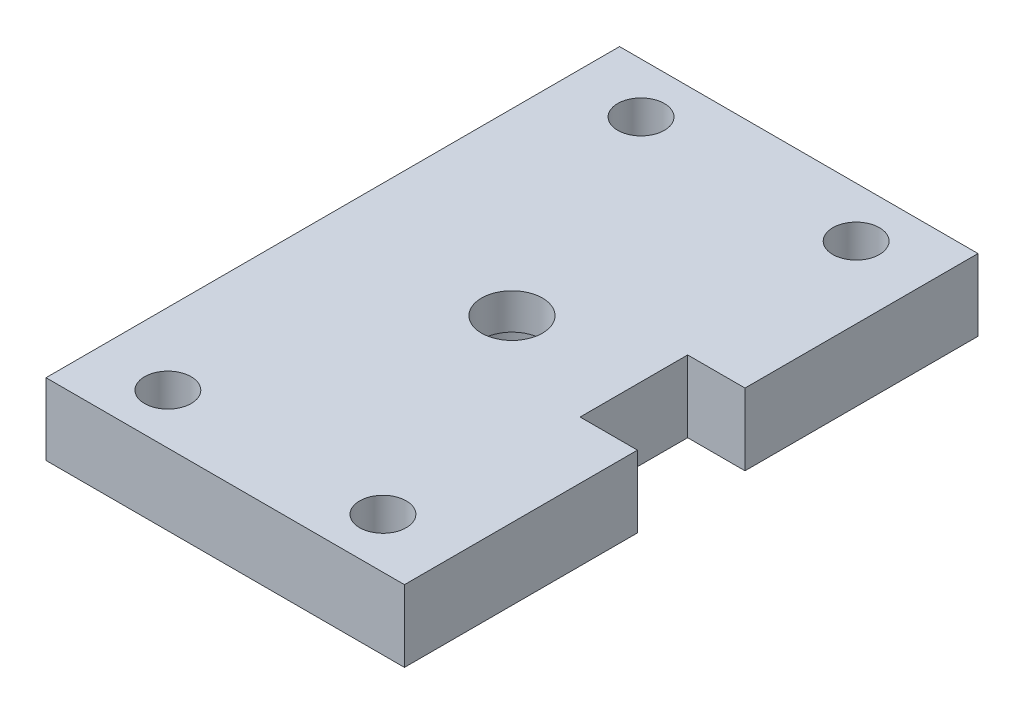
ISO-10303-21;
HEADER;
FILE_DESCRIPTION(('STEP AP214'),'2;1');
FILE_NAME('part.step','',(''),(''),'','','');
FILE_SCHEMA(('AUTOMOTIVE_DESIGN { 1 0 10303 214 1 1 1 1 }'));
ENDSEC;
DATA;
#1=APPLICATION_CONTEXT('core data for automotive mechanical design processes');
#2=APPLICATION_PROTOCOL_DEFINITION('international standard','automotive_design',2000,#1);
#3=PRODUCT_CONTEXT('',#1,'mechanical');
#4=PRODUCT('Part','Part','',(#3));
#5=PRODUCT_RELATED_PRODUCT_CATEGORY('part','',(#4));
#6=PRODUCT_DEFINITION_FORMATION('','',#4);
#7=PRODUCT_DEFINITION_CONTEXT('part definition',#1,'design');
#8=PRODUCT_DEFINITION('design','',#6,#7);
#9=PRODUCT_DEFINITION_SHAPE('','',#8);
#10=(LENGTH_UNIT() NAMED_UNIT(*) SI_UNIT(.MILLI.,.METRE.));
#11=(NAMED_UNIT(*) PLANE_ANGLE_UNIT() SI_UNIT($,.RADIAN.));
#12=(NAMED_UNIT(*) SI_UNIT($,.STERADIAN.) SOLID_ANGLE_UNIT());
#13=UNCERTAINTY_MEASURE_WITH_UNIT(LENGTH_MEASURE(1.E-05),#10,'distance_accuracy_value','');
#14=(GEOMETRIC_REPRESENTATION_CONTEXT(3) GLOBAL_UNCERTAINTY_ASSIGNED_CONTEXT((#13)) GLOBAL_UNIT_ASSIGNED_CONTEXT((#10,
#11,#12)) REPRESENTATION_CONTEXT('',''));
#15=CARTESIAN_POINT('',(0.,0.,0.));
#16=DIRECTION('',(0.,0.,1.));
#17=DIRECTION('',(1.,0.,0.));
#18=AXIS2_PLACEMENT_3D('',#15,#16,#17);
#19=CARTESIAN_POINT('',(30.890258641776,10.,46.7413790928147));
#20=DIRECTION('',(-1.,0.,0.));
#21=DIRECTION('',(0.,0.,1.));
#22=AXIS2_PLACEMENT_3D('',#19,#20,#21);
#23=PLANE('',#22);
#24=DIRECTION('',(0.,0.,-1.));
#25=VECTOR('',#24,1.);
#26=CARTESIAN_POINT('',(30.890258641776,10.,46.7413790928147));
#27=LINE('',#26,#25);
#28=CARTESIAN_POINT('',(30.890258641776,10.,-0.758620907185252));
#29=VERTEX_POINT('',#28);
#30=CARTESIAN_POINT('',(30.890258641776,10.,-33.2586209071853));
#31=VERTEX_POINT('',#30);
#32=EDGE_CURVE('E90',#29,#31,#27,.T.);
#33=ORIENTED_EDGE('',*,*,#32,.F.);
#34=DIRECTION('',(0.,1.,0.));
#35=VECTOR('',#34,1.);
#36=CARTESIAN_POINT('',(30.890258641776,0.,-0.758620907185252));
#37=LINE('',#36,#35);
#38=CARTESIAN_POINT('',(30.890258641776,0.,-0.758620907185252));
#39=VERTEX_POINT('',#38);
#40=EDGE_CURVE('E145',#39,#29,#37,.T.);
#41=ORIENTED_EDGE('',*,*,#40,.F.);
#42=DIRECTION('',(0.,0.,-1.));
#43=VECTOR('',#42,1.);
#44=CARTESIAN_POINT('',(30.890258641776,0.,46.7413790928147));
#45=LINE('',#44,#43);
#46=CARTESIAN_POINT('',(30.890258641776,0.,-33.2586209071853));
#47=VERTEX_POINT('',#46);
#48=EDGE_CURVE('E180',#39,#47,#45,.T.);
#49=ORIENTED_EDGE('',*,*,#48,.T.);
#50=DIRECTION('',(0.,-1.,0.));
#51=VECTOR('',#50,1.);
#52=CARTESIAN_POINT('',(30.890258641776,10.,-33.2586209071853));
#53=LINE('',#52,#51);
#54=EDGE_CURVE('E11',#31,#47,#53,.T.);
#55=ORIENTED_EDGE('',*,*,#54,.F.);
#56=EDGE_LOOP('',(#33,#41,#49,#55));
#57=FACE_BOUND('',#56,.T.);
#58=ADVANCED_FACE('F37',(#57),#23,.F.);
#59=CARTESIAN_POINT('',(5.89025864177597,10.001,6.74137909281474));
#60=DIRECTION('',(0.,-1.,0.));
#61=DIRECTION('',(0.,0.,-1.));
#62=AXIS2_PLACEMENT_3D('',#59,#60,#61);
#63=CYLINDRICAL_SURFACE('',#62,4.25);
#64=CARTESIAN_POINT('',(5.89025864177597,10.,6.74137909281474));
#65=DIRECTION('',(0.,-1.,0.));
#66=DIRECTION('',(0.,0.,-1.));
#67=AXIS2_PLACEMENT_3D('',#64,#65,#66);
#68=CIRCLE('',#67,4.25);
#69=CARTESIAN_POINT('',(5.89025864177597,10.,2.49137909281474));
#70=VERTEX_POINT('',#69);
#71=EDGE_CURVE('E175',#70,#70,#68,.F.);
#72=ORIENTED_EDGE('',*,*,#71,.T.);
#73=EDGE_LOOP('',(#72));
#74=FACE_BOUND('',#73,.T.);
#75=CARTESIAN_POINT('',(5.89025864177597,5.,6.74137909281474));
#76=DIRECTION('',(0.,-1.,0.));
#77=DIRECTION('',(0.,0.,-1.));
#78=AXIS2_PLACEMENT_3D('',#75,#76,#77);
#79=CIRCLE('',#78,4.25);
#80=CARTESIAN_POINT('',(5.89025864177597,5.,2.49137909281474));
#81=VERTEX_POINT('',#80);
#82=EDGE_CURVE('E41',#81,#81,#79,.F.);
#83=ORIENTED_EDGE('',*,*,#82,.F.);
#84=EDGE_LOOP('',(#83));
#85=FACE_BOUND('',#84,.T.);
#86=ADVANCED_FACE('F225',(#74,#85),#63,.F.);
#87=CARTESIAN_POINT('',(30.890258641776,0.,46.7413790928147));
#88=VERTEX_POINT('',#87);
#89=CARTESIAN_POINT('',(30.890258641776,0.,14.2413790928147));
#90=VERTEX_POINT('',#89);
#91=EDGE_CURVE('E189',#88,#90,#45,.T.);
#92=ORIENTED_EDGE('',*,*,#91,.T.);
#93=DIRECTION('',(0.,1.,0.));
#94=VECTOR('',#93,1.);
#95=CARTESIAN_POINT('',(30.890258641776,0.,14.2413790928147));
#96=LINE('',#95,#94);
#97=CARTESIAN_POINT('',(30.890258641776,10.,14.2413790928147));
#98=VERTEX_POINT('',#97);
#99=EDGE_CURVE('E53',#90,#98,#96,.T.);
#100=ORIENTED_EDGE('',*,*,#99,.T.);
#101=CARTESIAN_POINT('',(30.890258641776,10.,46.7413790928147));
#102=VERTEX_POINT('',#101);
#103=EDGE_CURVE('E181',#102,#98,#27,.T.);
#104=ORIENTED_EDGE('',*,*,#103,.F.);
#105=DIRECTION('',(0.,-1.,0.));
#106=VECTOR('',#105,1.);
#107=CARTESIAN_POINT('',(30.890258641776,10.,46.7413790928147));
#108=LINE('',#107,#106);
#109=EDGE_CURVE('E188',#102,#88,#108,.T.);
#110=ORIENTED_EDGE('',*,*,#109,.T.);
#111=EDGE_LOOP('',(#92,#100,#104,#110));
#112=FACE_BOUND('',#111,.T.);
#113=ADVANCED_FACE('F39',(#112),#23,.F.);
#114=CARTESIAN_POINT('',(-19.109741358224,10.,-33.2586209071853));
#115=DIRECTION('',(0.,0.,1.));
#116=DIRECTION('',(1.,0.,0.));
#117=AXIS2_PLACEMENT_3D('',#114,#115,#116);
#118=PLANE('',#117);
#119=DIRECTION('',(-1.,0.,0.));
#120=VECTOR('',#119,1.);
#121=CARTESIAN_POINT('',(-19.109741358224,0.,-33.2586209071853));
#122=LINE('',#121,#120);
#123=CARTESIAN_POINT('',(-19.109741358224,0.,-33.2586209071853));
#124=VERTEX_POINT('',#123);
#125=EDGE_CURVE('E191',#47,#124,#122,.T.);
#126=ORIENTED_EDGE('',*,*,#125,.T.);
#127=DIRECTION('',(0.,-1.,0.));
#128=VECTOR('',#127,1.);
#129=CARTESIAN_POINT('',(-19.109741358224,10.,-33.2586209071853));
#130=LINE('',#129,#128);
#131=CARTESIAN_POINT('',(-19.109741358224,10.,-33.2586209071853));
#132=VERTEX_POINT('',#131);
#133=EDGE_CURVE('E46',#132,#124,#130,.T.);
#134=ORIENTED_EDGE('',*,*,#133,.F.);
#135=DIRECTION('',(-1.,0.,0.));
#136=VECTOR('',#135,1.);
#137=CARTESIAN_POINT('',(-19.109741358224,10.,-33.2586209071853));
#138=LINE('',#137,#136);
#139=EDGE_CURVE('E183',#31,#132,#138,.T.);
#140=ORIENTED_EDGE('',*,*,#139,.F.);
#141=ORIENTED_EDGE('',*,*,#54,.T.);
#142=EDGE_LOOP('',(#126,#134,#140,#141));
#143=FACE_BOUND('',#142,.T.);
#144=ADVANCED_FACE('F221',(#143),#118,.F.);
#145=CARTESIAN_POINT('',(-19.109741358224,10.,46.7413790928147));
#146=DIRECTION('',(1.,0.,0.));
#147=DIRECTION('',(0.,0.,-1.));
#148=AXIS2_PLACEMENT_3D('',#145,#146,#147);
#149=PLANE('',#148);
#150=DIRECTION('',(0.,0.,1.));
#151=VECTOR('',#150,1.);
#152=CARTESIAN_POINT('',(-19.109741358224,0.,46.7413790928147));
#153=LINE('',#152,#151);
#154=CARTESIAN_POINT('',(-19.109741358224,0.,46.7413790928147));
#155=VERTEX_POINT('',#154);
#156=EDGE_CURVE('E193',#124,#155,#153,.T.);
#157=ORIENTED_EDGE('',*,*,#156,.T.);
#158=DIRECTION('',(0.,-1.,0.));
#159=VECTOR('',#158,1.);
#160=CARTESIAN_POINT('',(-19.109741358224,10.,46.7413790928147));
#161=LINE('',#160,#159);
#162=CARTESIAN_POINT('',(-19.109741358224,10.,46.7413790928147));
#163=VERTEX_POINT('',#162);
#164=EDGE_CURVE('E197',#163,#155,#161,.T.);
#165=ORIENTED_EDGE('',*,*,#164,.F.);
#166=DIRECTION('',(0.,0.,1.));
#167=VECTOR('',#166,1.);
#168=CARTESIAN_POINT('',(-19.109741358224,10.,46.7413790928147));
#169=LINE('',#168,#167);
#170=EDGE_CURVE('E185',#132,#163,#169,.T.);
#171=ORIENTED_EDGE('',*,*,#170,.F.);
#172=ORIENTED_EDGE('',*,*,#133,.T.);
#173=EDGE_LOOP('',(#157,#165,#171,#172));
#174=FACE_BOUND('',#173,.T.);
#175=ADVANCED_FACE('F204',(#174),#149,.F.);
#176=CARTESIAN_POINT('',(-19.109741358224,10.,46.7413790928147));
#177=DIRECTION('',(0.,0.,-1.));
#178=DIRECTION('',(-1.,0.,0.));
#179=AXIS2_PLACEMENT_3D('',#176,#177,#178);
#180=PLANE('',#179);
#181=DIRECTION('',(1.,0.,0.));
#182=VECTOR('',#181,1.);
#183=CARTESIAN_POINT('',(-19.109741358224,0.,46.7413790928147));
#184=LINE('',#183,#182);
#185=EDGE_CURVE('E83',#155,#88,#184,.T.);
#186=ORIENTED_EDGE('',*,*,#185,.T.);
#187=ORIENTED_EDGE('',*,*,#109,.F.);
#188=DIRECTION('',(1.,0.,0.));
#189=VECTOR('',#188,1.);
#190=CARTESIAN_POINT('',(-19.109741358224,10.,46.7413790928147));
#191=LINE('',#190,#189);
#192=EDGE_CURVE('E62',#163,#102,#191,.T.);
#193=ORIENTED_EDGE('',*,*,#192,.F.);
#194=ORIENTED_EDGE('',*,*,#164,.T.);
#195=EDGE_LOOP('',(#186,#187,#193,#194));
#196=FACE_BOUND('',#195,.T.);
#197=ADVANCED_FACE('F210',(#196),#180,.F.);
#198=CARTESIAN_POINT('',(0.,10.,0.));
#199=DIRECTION('',(0.,-1.,0.));
#200=DIRECTION('',(0.,0.,-1.));
#201=AXIS2_PLACEMENT_3D('',#198,#199,#200);
#202=PLANE('',#201);
#203=CARTESIAN_POINT('',(20.890258641776,10.,39.7413790928147));
#204=DIRECTION('',(0.,1.,0.));
#205=DIRECTION('',(0.,0.,1.));
#206=AXIS2_PLACEMENT_3D('',#203,#204,#205);
#207=CIRCLE('',#206,3.25);
#208=CARTESIAN_POINT('',(20.890258641776,10.,42.9913790928148));
#209=VERTEX_POINT('',#208);
#210=EDGE_CURVE('E160',#209,#209,#207,.T.);
#211=ORIENTED_EDGE('',*,*,#210,.F.);
#212=EDGE_LOOP('',(#211));
#213=FACE_BOUND('',#212,.T.);
#214=CARTESIAN_POINT('',(-9.10974135822403,10.,-26.2586209071853));
#215=DIRECTION('',(0.,1.,0.));
#216=DIRECTION('',(0.,0.,1.));
#217=AXIS2_PLACEMENT_3D('',#214,#215,#216);
#218=CIRCLE('',#217,3.25);
#219=CARTESIAN_POINT('',(-9.10974135822403,10.,-23.0086209071853));
#220=VERTEX_POINT('',#219);
#221=EDGE_CURVE('E167',#220,#220,#218,.T.);
#222=ORIENTED_EDGE('',*,*,#221,.F.);
#223=EDGE_LOOP('',(#222));
#224=FACE_BOUND('',#223,.T.);
#225=CARTESIAN_POINT('',(20.890258641776,10.,-26.2586209071853));
#226=DIRECTION('',(0.,1.,0.));
#227=DIRECTION('',(0.,0.,1.));
#228=AXIS2_PLACEMENT_3D('',#225,#226,#227);
#229=CIRCLE('',#228,3.25);
#230=CARTESIAN_POINT('',(20.890258641776,10.,-23.0086209071853));
#231=VERTEX_POINT('',#230);
#232=EDGE_CURVE('E153',#231,#231,#229,.T.);
#233=ORIENTED_EDGE('',*,*,#232,.F.);
#234=EDGE_LOOP('',(#233));
#235=FACE_BOUND('',#234,.T.);
#236=CARTESIAN_POINT('',(-9.10974135822403,10.,39.7413790928148));
#237=DIRECTION('',(0.,1.,0.));
#238=DIRECTION('',(0.,0.,1.));
#239=AXIS2_PLACEMENT_3D('',#236,#237,#238);
#240=CIRCLE('',#239,3.25);
#241=CARTESIAN_POINT('',(-9.10974135822403,10.,42.9913790928148));
#242=VERTEX_POINT('',#241);
#243=EDGE_CURVE('E172',#242,#242,#240,.T.);
#244=ORIENTED_EDGE('',*,*,#243,.F.);
#245=EDGE_LOOP('',(#244));
#246=FACE_BOUND('',#245,.T.);
#247=ORIENTED_EDGE('',*,*,#71,.F.);
#248=EDGE_LOOP('',(#247));
#249=FACE_BOUND('',#248,.T.);
#250=DIRECTION('',(0.,0.,1.));
#251=VECTOR('',#250,1.);
#252=CARTESIAN_POINT('',(22.890258641776,10.,14.2413790928147));
#253=LINE('',#252,#251);
#254=CARTESIAN_POINT('',(22.890258641776,10.,-0.758620907185252));
#255=VERTEX_POINT('',#254);
#256=CARTESIAN_POINT('',(22.890258641776,10.,14.2413790928147));
#257=VERTEX_POINT('',#256);
#258=EDGE_CURVE('E120',#255,#257,#253,.T.);
#259=ORIENTED_EDGE('',*,*,#258,.F.);
#260=DIRECTION('',(-1.,0.,0.));
#261=VECTOR('',#260,1.);
#262=CARTESIAN_POINT('',(22.890258641776,10.,-0.758620907185252));
#263=LINE('',#262,#261);
#264=EDGE_CURVE('E133',#29,#255,#263,.T.);
#265=ORIENTED_EDGE('',*,*,#264,.F.);
#266=ORIENTED_EDGE('',*,*,#32,.T.);
#267=ORIENTED_EDGE('',*,*,#139,.T.);
#268=ORIENTED_EDGE('',*,*,#170,.T.);
#269=ORIENTED_EDGE('',*,*,#192,.T.);
#270=ORIENTED_EDGE('',*,*,#103,.T.);
#271=DIRECTION('',(1.,0.,0.));
#272=VECTOR('',#271,1.);
#273=CARTESIAN_POINT('',(22.890258641776,10.,14.2413790928147));
#274=LINE('',#273,#272);
#275=EDGE_CURVE('E136',#257,#98,#274,.T.);
#276=ORIENTED_EDGE('',*,*,#275,.F.);
#277=EDGE_LOOP('',(#259,#265,#266,#267,#268,#269,#270,#276));
#278=FACE_BOUND('',#277,.T.);
#279=ADVANCED_FACE('F212',(#213,#224,#235,#246,#249,#278),#202,.F.);
#280=CARTESIAN_POINT('',(0.,0.,0.));
#281=DIRECTION('',(0.,-1.,0.));
#282=DIRECTION('',(0.,0.,-1.));
#283=AXIS2_PLACEMENT_3D('',#280,#281,#282);
#284=PLANE('',#283);
#285=DIRECTION('',(-1.,0.,0.));
#286=VECTOR('',#285,1.);
#287=CARTESIAN_POINT('',(22.890258641776,0.,-0.758620907185252));
#288=LINE('',#287,#286);
#289=CARTESIAN_POINT('',(22.890258641776,0.,-0.758620907185252));
#290=VERTEX_POINT('',#289);
#291=EDGE_CURVE('E122',#39,#290,#288,.T.);
#292=ORIENTED_EDGE('',*,*,#291,.T.);
#293=DIRECTION('',(0.,0.,1.));
#294=VECTOR('',#293,1.);
#295=CARTESIAN_POINT('',(22.890258641776,0.,14.2413790928147));
#296=LINE('',#295,#294);
#297=CARTESIAN_POINT('',(22.890258641776,0.,14.2413790928147));
#298=VERTEX_POINT('',#297);
#299=EDGE_CURVE('E117',#290,#298,#296,.T.);
#300=ORIENTED_EDGE('',*,*,#299,.T.);
#301=DIRECTION('',(1.,0.,0.));
#302=VECTOR('',#301,1.);
#303=CARTESIAN_POINT('',(22.890258641776,0.,14.2413790928147));
#304=LINE('',#303,#302);
#305=EDGE_CURVE('E124',#298,#90,#304,.T.);
#306=ORIENTED_EDGE('',*,*,#305,.T.);
#307=ORIENTED_EDGE('',*,*,#91,.F.);
#308=ORIENTED_EDGE('',*,*,#185,.F.);
#309=ORIENTED_EDGE('',*,*,#156,.F.);
#310=ORIENTED_EDGE('',*,*,#125,.F.);
#311=ORIENTED_EDGE('',*,*,#48,.F.);
#312=EDGE_LOOP('',(#292,#300,#306,#307,#308,#309,#310,#311));
#313=FACE_BOUND('',#312,.T.);
#314=CARTESIAN_POINT('',(5.89025864177589,0.,6.74137909281491));
#315=DIRECTION('',(0.,-1.,0.));
#316=DIRECTION('',(0.,0.,-1.));
#317=AXIS2_PLACEMENT_3D('',#314,#315,#316);
#318=CIRCLE('',#317,7.5);
#319=CARTESIAN_POINT('',(5.89025864177589,0.,-0.758620907185085));
#320=VERTEX_POINT('',#319);
#321=EDGE_CURVE('E144',#320,#320,#318,.T.);
#322=ORIENTED_EDGE('',*,*,#321,.F.);
#323=EDGE_LOOP('',(#322));
#324=FACE_BOUND('',#323,.T.);
#325=CARTESIAN_POINT('',(20.890258641776,0.,39.7413790928147));
#326=DIRECTION('',(0.,-1.,0.));
#327=DIRECTION('',(0.,0.,-1.));
#328=AXIS2_PLACEMENT_3D('',#325,#326,#327);
#329=CIRCLE('',#328,3.25);
#330=CARTESIAN_POINT('',(20.890258641776,0.,36.4913790928147));
#331=VERTEX_POINT('',#330);
#332=EDGE_CURVE('E164',#331,#331,#329,.F.);
#333=ORIENTED_EDGE('',*,*,#332,.T.);
#334=EDGE_LOOP('',(#333));
#335=FACE_BOUND('',#334,.T.);
#336=CARTESIAN_POINT('',(-9.10974135822403,0.,-26.2586209071853));
#337=DIRECTION('',(0.,-1.,0.));
#338=DIRECTION('',(0.,0.,-1.));
#339=AXIS2_PLACEMENT_3D('',#336,#337,#338);
#340=CIRCLE('',#339,3.25);
#341=CARTESIAN_POINT('',(-9.10974135822403,0.,-29.5086209071853));
#342=VERTEX_POINT('',#341);
#343=EDGE_CURVE('E156',#342,#342,#340,.F.);
#344=ORIENTED_EDGE('',*,*,#343,.T.);
#345=EDGE_LOOP('',(#344));
#346=FACE_BOUND('',#345,.T.);
#347=CARTESIAN_POINT('',(20.890258641776,0.,-26.2586209071853));
#348=DIRECTION('',(0.,-1.,0.));
#349=DIRECTION('',(0.,0.,-1.));
#350=AXIS2_PLACEMENT_3D('',#347,#348,#349);
#351=CIRCLE('',#350,3.25);
#352=CARTESIAN_POINT('',(20.890258641776,0.,-29.5086209071853));
#353=VERTEX_POINT('',#352);
#354=EDGE_CURVE('E157',#353,#353,#351,.F.);
#355=ORIENTED_EDGE('',*,*,#354,.T.);
#356=EDGE_LOOP('',(#355));
#357=FACE_BOUND('',#356,.T.);
#358=CARTESIAN_POINT('',(-9.10974135822403,0.,39.7413790928148));
#359=DIRECTION('',(0.,-1.,0.));
#360=DIRECTION('',(0.,0.,-1.));
#361=AXIS2_PLACEMENT_3D('',#358,#359,#360);
#362=CIRCLE('',#361,3.25);
#363=CARTESIAN_POINT('',(-9.10974135822403,0.,36.4913790928148));
#364=VERTEX_POINT('',#363);
#365=EDGE_CURVE('E163',#364,#364,#362,.F.);
#366=ORIENTED_EDGE('',*,*,#365,.T.);
#367=EDGE_LOOP('',(#366));
#368=FACE_BOUND('',#367,.T.);
#369=ADVANCED_FACE('F130',(#313,#324,#335,#346,#357,#368),#284,.T.);
#370=CARTESIAN_POINT('',(-9.10974135822403,-0.000999999999999265,39.7413790928148));
#371=DIRECTION('',(0.,1.,0.));
#372=DIRECTION('',(0.,0.,1.));
#373=AXIS2_PLACEMENT_3D('',#370,#371,#372);
#374=CYLINDRICAL_SURFACE('',#373,3.25);
#375=ORIENTED_EDGE('',*,*,#365,.F.);
#376=EDGE_LOOP('',(#375));
#377=FACE_BOUND('',#376,.T.);
#378=ORIENTED_EDGE('',*,*,#243,.T.);
#379=EDGE_LOOP('',(#378));
#380=FACE_BOUND('',#379,.T.);
#381=ADVANCED_FACE('F265',(#377,#380),#374,.F.);
#382=CARTESIAN_POINT('',(20.890258641776,-0.000999999999999265,-26.2586209071853));
#383=DIRECTION('',(0.,1.,0.));
#384=DIRECTION('',(0.,0.,1.));
#385=AXIS2_PLACEMENT_3D('',#382,#383,#384);
#386=CYLINDRICAL_SURFACE('',#385,3.25);
#387=ORIENTED_EDGE('',*,*,#354,.F.);
#388=EDGE_LOOP('',(#387));
#389=FACE_BOUND('',#388,.T.);
#390=ORIENTED_EDGE('',*,*,#232,.T.);
#391=EDGE_LOOP('',(#390));
#392=FACE_BOUND('',#391,.T.);
#393=ADVANCED_FACE('F261',(#389,#392),#386,.F.);
#394=CARTESIAN_POINT('',(-9.10974135822403,-0.000999999999999265,-26.2586209071853));
#395=DIRECTION('',(0.,1.,0.));
#396=DIRECTION('',(0.,0.,1.));
#397=AXIS2_PLACEMENT_3D('',#394,#395,#396);
#398=CYLINDRICAL_SURFACE('',#397,3.25);
#399=ORIENTED_EDGE('',*,*,#343,.F.);
#400=EDGE_LOOP('',(#399));
#401=FACE_BOUND('',#400,.T.);
#402=ORIENTED_EDGE('',*,*,#221,.T.);
#403=EDGE_LOOP('',(#402));
#404=FACE_BOUND('',#403,.T.);
#405=ADVANCED_FACE('F264',(#401,#404),#398,.F.);
#406=CARTESIAN_POINT('',(20.890258641776,-0.000999999999999265,39.7413790928147));
#407=DIRECTION('',(0.,1.,0.));
#408=DIRECTION('',(0.,0.,1.));
#409=AXIS2_PLACEMENT_3D('',#406,#407,#408);
#410=CYLINDRICAL_SURFACE('',#409,3.25);
#411=ORIENTED_EDGE('',*,*,#332,.F.);
#412=EDGE_LOOP('',(#411));
#413=FACE_BOUND('',#412,.T.);
#414=ORIENTED_EDGE('',*,*,#210,.T.);
#415=EDGE_LOOP('',(#414));
#416=FACE_BOUND('',#415,.T.);
#417=ADVANCED_FACE('F256',(#413,#416),#410,.F.);
#418=CARTESIAN_POINT('',(5.89025864177589,5.,6.74137909281491));
#419=DIRECTION('',(0.,-1.,0.));
#420=DIRECTION('',(0.,0.,-1.));
#421=AXIS2_PLACEMENT_3D('',#418,#419,#420);
#422=PLANE('',#421);
#423=CARTESIAN_POINT('',(5.89025864177589,5.,6.74137909281491));
#424=DIRECTION('',(0.,-1.,0.));
#425=DIRECTION('',(0.,0.,-1.));
#426=AXIS2_PLACEMENT_3D('',#423,#424,#425);
#427=CIRCLE('',#426,7.5);
#428=CARTESIAN_POINT('',(5.89025864177589,5.,-0.758620907185085));
#429=VERTEX_POINT('',#428);
#430=EDGE_CURVE('E148',#429,#429,#427,.T.);
#431=ORIENTED_EDGE('',*,*,#430,.T.);
#432=EDGE_LOOP('',(#431));
#433=FACE_BOUND('',#432,.T.);
#434=ORIENTED_EDGE('',*,*,#82,.T.);
#435=EDGE_LOOP('',(#434));
#436=FACE_BOUND('',#435,.T.);
#437=ADVANCED_FACE('F253',(#433,#436),#422,.T.);
#438=CARTESIAN_POINT('',(5.89025864177589,5.,6.74137909281491));
#439=DIRECTION('',(0.,-1.,0.));
#440=DIRECTION('',(0.,0.,-1.));
#441=AXIS2_PLACEMENT_3D('',#438,#439,#440);
#442=CYLINDRICAL_SURFACE('',#441,7.5);
#443=ORIENTED_EDGE('',*,*,#430,.F.);
#444=EDGE_LOOP('',(#443));
#445=FACE_BOUND('',#444,.T.);
#446=ORIENTED_EDGE('',*,*,#321,.T.);
#447=EDGE_LOOP('',(#446));
#448=FACE_BOUND('',#447,.T.);
#449=ADVANCED_FACE('F250',(#445,#448),#442,.F.);
#450=CARTESIAN_POINT('',(22.890258641776,0.,14.2413790928147));
#451=DIRECTION('',(-1.,0.,0.));
#452=DIRECTION('',(0.,0.,1.));
#453=AXIS2_PLACEMENT_3D('',#450,#451,#452);
#454=PLANE('',#453);
#455=ORIENTED_EDGE('',*,*,#258,.T.);
#456=DIRECTION('',(0.,1.,0.));
#457=VECTOR('',#456,1.);
#458=CARTESIAN_POINT('',(22.890258641776,0.,14.2413790928147));
#459=LINE('',#458,#457);
#460=EDGE_CURVE('E114',#298,#257,#459,.T.);
#461=ORIENTED_EDGE('',*,*,#460,.F.);
#462=ORIENTED_EDGE('',*,*,#299,.F.);
#463=DIRECTION('',(0.,1.,0.));
#464=VECTOR('',#463,1.);
#465=CARTESIAN_POINT('',(22.890258641776,0.,-0.758620907185252));
#466=LINE('',#465,#464);
#467=EDGE_CURVE('E142',#290,#255,#466,.T.);
#468=ORIENTED_EDGE('',*,*,#467,.T.);
#469=EDGE_LOOP('',(#455,#461,#462,#468));
#470=FACE_BOUND('',#469,.T.);
#471=ADVANCED_FACE('F115',(#470),#454,.F.);
#472=CARTESIAN_POINT('',(22.890258641776,0.,-0.758620907185252));
#473=DIRECTION('',(0.,0.,-1.));
#474=DIRECTION('',(-1.,0.,0.));
#475=AXIS2_PLACEMENT_3D('',#472,#473,#474);
#476=PLANE('',#475);
#477=ORIENTED_EDGE('',*,*,#264,.T.);
#478=ORIENTED_EDGE('',*,*,#467,.F.);
#479=ORIENTED_EDGE('',*,*,#291,.F.);
#480=ORIENTED_EDGE('',*,*,#40,.T.);
#481=EDGE_LOOP('',(#477,#478,#479,#480));
#482=FACE_BOUND('',#481,.T.);
#483=ADVANCED_FACE('F242',(#482),#476,.F.);
#484=CARTESIAN_POINT('',(22.890258641776,0.,14.2413790928147));
#485=DIRECTION('',(0.,0.,1.));
#486=DIRECTION('',(1.,0.,0.));
#487=AXIS2_PLACEMENT_3D('',#484,#485,#486);
#488=PLANE('',#487);
#489=ORIENTED_EDGE('',*,*,#275,.T.);
#490=ORIENTED_EDGE('',*,*,#99,.F.);
#491=ORIENTED_EDGE('',*,*,#305,.F.);
#492=ORIENTED_EDGE('',*,*,#460,.T.);
#493=EDGE_LOOP('',(#489,#490,#491,#492));
#494=FACE_BOUND('',#493,.T.);
#495=ADVANCED_FACE('F125',(#494),#488,.F.);
#496=CLOSED_SHELL('',(#58,#86,#113,#144,#175,#197,#279,#369,#381,#393,#405,#417,#437,#449,#471,
#483,#495));
#497=MANIFOLD_SOLID_BREP('B2',#496);
#498=ADVANCED_BREP_SHAPE_REPRESENTATION('',(#18,#497),#14);
#499=SHAPE_DEFINITION_REPRESENTATION(#9,#498);
ENDSEC;
END-ISO-10303-21;
